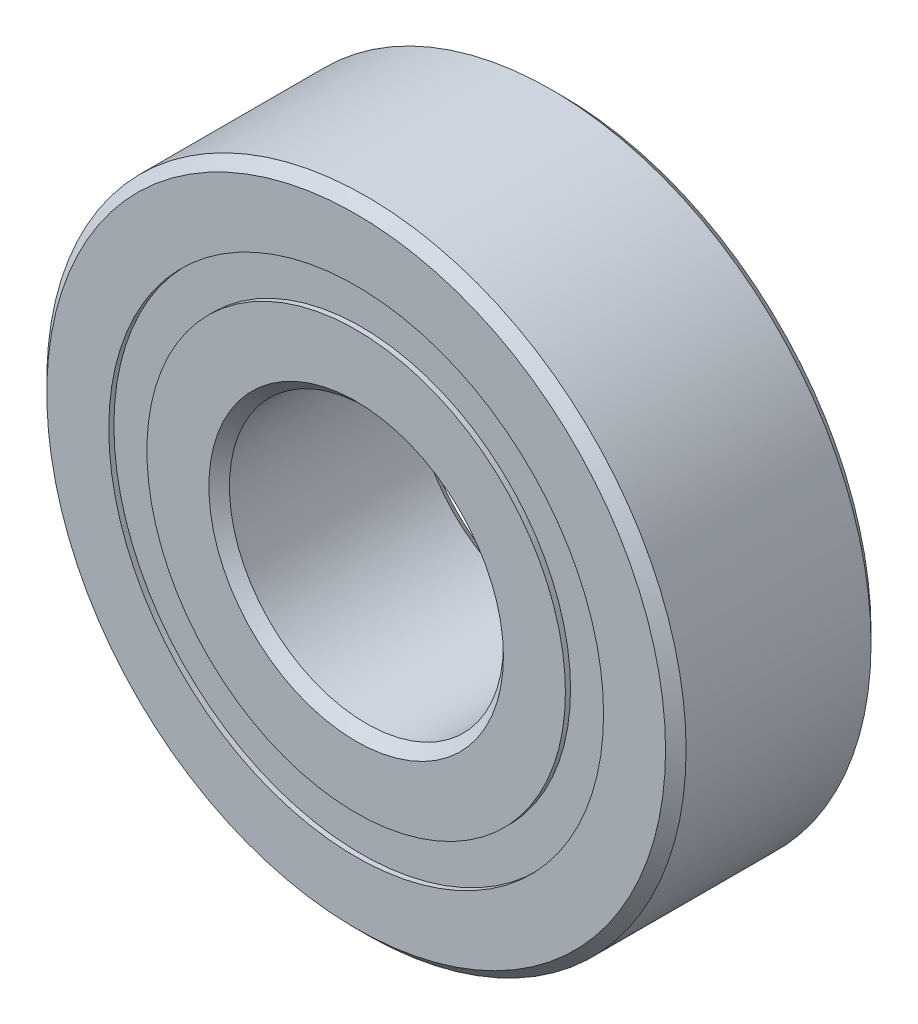
ISO-10303-21;
HEADER;
FILE_DESCRIPTION(('STEP AP214'),'2;1');
FILE_NAME('part.step','',(''),(''),'','','');
FILE_SCHEMA(('AUTOMOTIVE_DESIGN { 1 0 10303 214 1 1 1 1 }'));
ENDSEC;
DATA;
#1=APPLICATION_CONTEXT('core data for automotive mechanical design processes');
#2=APPLICATION_PROTOCOL_DEFINITION('international standard','automotive_design',2000,#1);
#3=PRODUCT_CONTEXT('',#1,'mechanical');
#4=PRODUCT('Part','Part','',(#3));
#5=PRODUCT_RELATED_PRODUCT_CATEGORY('part','',(#4));
#6=PRODUCT_DEFINITION_FORMATION('','',#4);
#7=PRODUCT_DEFINITION_CONTEXT('part definition',#1,'design');
#8=PRODUCT_DEFINITION('design','',#6,#7);
#9=PRODUCT_DEFINITION_SHAPE('','',#8);
#10=(LENGTH_UNIT() NAMED_UNIT(*) SI_UNIT(.MILLI.,.METRE.));
#11=(NAMED_UNIT(*) PLANE_ANGLE_UNIT() SI_UNIT($,.RADIAN.));
#12=(NAMED_UNIT(*) SI_UNIT($,.STERADIAN.) SOLID_ANGLE_UNIT());
#13=UNCERTAINTY_MEASURE_WITH_UNIT(LENGTH_MEASURE(1.E-05),#10,'distance_accuracy_value','');
#14=(GEOMETRIC_REPRESENTATION_CONTEXT(3) GLOBAL_UNCERTAINTY_ASSIGNED_CONTEXT((#13)) GLOBAL_UNIT_ASSIGNED_CONTEXT((#10,
#11,#12)) REPRESENTATION_CONTEXT('',''));
#15=CARTESIAN_POINT('',(0.,0.,0.));
#16=DIRECTION('',(0.,0.,1.));
#17=DIRECTION('',(1.,0.,0.));
#18=AXIS2_PLACEMENT_3D('',#15,#16,#17);
#19=CARTESIAN_POINT('',(0.,8.60041208791209,-3.39328125));
#20=DIRECTION('',(0.,0.,1.));
#21=DIRECTION('',(1.,0.,0.));
#22=AXIS2_PLACEMENT_3D('',#19,#20,#21);
#23=PLANE('',#22);
#24=CARTESIAN_POINT('',(0.,0.,-3.39328125));
#25=DIRECTION('',(0.,0.,1.));
#26=DIRECTION('',(1.,0.,0.));
#27=AXIS2_PLACEMENT_3D('',#24,#25,#26);
#28=CIRCLE('',#27,8.60041208791209);
#29=CARTESIAN_POINT('',(8.60041208791209,0.,-3.39328125));
#30=VERTEX_POINT('',#29);
#31=EDGE_CURVE('E63',#30,#30,#28,.T.);
#32=ORIENTED_EDGE('',*,*,#31,.F.);
#33=EDGE_LOOP('',(#32));
#34=FACE_BOUND('',#33,.T.);
#35=CARTESIAN_POINT('',(0.,0.,-3.39328125));
#36=DIRECTION('',(0.,0.,1.));
#37=DIRECTION('',(1.,0.,0.));
#38=AXIS2_PLACEMENT_3D('',#35,#36,#37);
#39=CIRCLE('',#38,7.27458791208791);
#40=CARTESIAN_POINT('',(7.27458791208791,0.,-3.39328125));
#41=VERTEX_POINT('',#40);
#42=EDGE_CURVE('E11',#41,#41,#39,.T.);
#43=ORIENTED_EDGE('',*,*,#42,.T.);
#44=EDGE_LOOP('',(#43));
#45=FACE_BOUND('',#44,.T.);
#46=ADVANCED_FACE('F45',(#34,#45),#23,.F.);
#47=CARTESIAN_POINT('',(0.,0.,3.571875));
#48=DIRECTION('',(0.,0.,1.));
#49=DIRECTION('',(1.,0.,0.));
#50=AXIS2_PLACEMENT_3D('',#47,#48,#49);
#51=CYLINDRICAL_SURFACE('',#50,7.27458791208791);
#52=ORIENTED_EDGE('',*,*,#42,.F.);
#53=EDGE_LOOP('',(#52));
#54=FACE_BOUND('',#53,.T.);
#55=CARTESIAN_POINT('',(0.,0.,-1.72035132641562));
#56=DIRECTION('',(0.,0.,1.));
#57=DIRECTION('',(1.,0.,0.));
#58=AXIS2_PLACEMENT_3D('',#55,#56,#57);
#59=CIRCLE('',#58,7.27458791208791);
#60=CARTESIAN_POINT('',(7.27458791208791,0.,-1.72035132641562));
#61=VERTEX_POINT('',#60);
#62=EDGE_CURVE('E52',#61,#61,#59,.T.);
#63=ORIENTED_EDGE('',*,*,#62,.T.);
#64=EDGE_LOOP('',(#63));
#65=FACE_BOUND('',#64,.T.);
#66=ADVANCED_FACE('F72',(#54,#65),#51,.F.);
#67=CARTESIAN_POINT('',(0.,8.60041208791209,-1.72035132641562));
#68=DIRECTION('',(0.,0.,-1.));
#69=DIRECTION('',(-1.,0.,0.));
#70=AXIS2_PLACEMENT_3D('',#67,#68,#69);
#71=PLANE('',#70);
#72=ORIENTED_EDGE('',*,*,#62,.F.);
#73=EDGE_LOOP('',(#72));
#74=FACE_BOUND('',#73,.T.);
#75=CARTESIAN_POINT('',(0.,0.,-1.72035132641562));
#76=DIRECTION('',(0.,0.,1.));
#77=DIRECTION('',(1.,0.,0.));
#78=AXIS2_PLACEMENT_3D('',#75,#76,#77);
#79=CIRCLE('',#78,8.60041208791209);
#80=CARTESIAN_POINT('',(8.60041208791209,0.,-1.72035132641562));
#81=VERTEX_POINT('',#80);
#82=EDGE_CURVE('E58',#81,#81,#79,.T.);
#83=ORIENTED_EDGE('',*,*,#82,.T.);
#84=EDGE_LOOP('',(#83));
#85=FACE_BOUND('',#84,.T.);
#86=ADVANCED_FACE('F76',(#74,#85),#71,.F.);
#87=CARTESIAN_POINT('',(0.,0.,3.571875));
#88=DIRECTION('',(0.,0.,1.));
#89=DIRECTION('',(1.,0.,0.));
#90=AXIS2_PLACEMENT_3D('',#87,#88,#89);
#91=CYLINDRICAL_SURFACE('',#90,8.60041208791209);
#92=ORIENTED_EDGE('',*,*,#82,.F.);
#93=EDGE_LOOP('',(#92));
#94=FACE_BOUND('',#93,.T.);
#95=ORIENTED_EDGE('',*,*,#31,.T.);
#96=EDGE_LOOP('',(#95));
#97=FACE_BOUND('',#96,.T.);
#98=ADVANCED_FACE('F69',(#94,#97),#91,.T.);
#99=CLOSED_SHELL('',(#46,#66,#86,#98));
#100=MANIFOLD_SOLID_BREP('B2',#99);
#101=CARTESIAN_POINT('',(0.,8.60041208791209,3.39328125));
#102=DIRECTION('',(0.,0.,-1.));
#103=DIRECTION('',(-1.,0.,0.));
#104=AXIS2_PLACEMENT_3D('',#101,#102,#103);
#105=PLANE('',#104);
#106=CARTESIAN_POINT('',(0.,0.,3.39328125));
#107=DIRECTION('',(0.,0.,1.));
#108=DIRECTION('',(1.,0.,0.));
#109=AXIS2_PLACEMENT_3D('',#106,#107,#108);
#110=CIRCLE('',#109,7.27458791208791);
#111=CARTESIAN_POINT('',(7.27458791208791,0.,3.39328125));
#112=VERTEX_POINT('',#111);
#113=EDGE_CURVE('E44',#112,#112,#110,.T.);
#114=ORIENTED_EDGE('',*,*,#113,.F.);
#115=EDGE_LOOP('',(#114));
#116=FACE_BOUND('',#115,.T.);
#117=CARTESIAN_POINT('',(0.,0.,3.39328125));
#118=DIRECTION('',(0.,0.,1.));
#119=DIRECTION('',(1.,0.,0.));
#120=AXIS2_PLACEMENT_3D('',#117,#118,#119);
#121=CIRCLE('',#120,8.60041208791209);
#122=CARTESIAN_POINT('',(8.60041208791209,0.,3.39328125));
#123=VERTEX_POINT('',#122);
#124=EDGE_CURVE('E134',#123,#123,#121,.T.);
#125=ORIENTED_EDGE('',*,*,#124,.T.);
#126=EDGE_LOOP('',(#125));
#127=FACE_BOUND('',#126,.T.);
#128=ADVANCED_FACE('F116',(#116,#127),#105,.F.);
#129=CARTESIAN_POINT('',(0.,0.,3.571875));
#130=DIRECTION('',(0.,0.,1.));
#131=DIRECTION('',(1.,0.,0.));
#132=AXIS2_PLACEMENT_3D('',#129,#130,#131);
#133=CYLINDRICAL_SURFACE('',#132,7.27458791208791);
#134=CARTESIAN_POINT('',(0.,0.,1.72035132641561));
#135=DIRECTION('',(0.,0.,1.));
#136=DIRECTION('',(1.,0.,0.));
#137=AXIS2_PLACEMENT_3D('',#134,#135,#136);
#138=CIRCLE('',#137,7.27458791208791);
#139=CARTESIAN_POINT('',(7.27458791208791,0.,1.72035132641561));
#140=VERTEX_POINT('',#139);
#141=EDGE_CURVE('E123',#140,#140,#138,.T.);
#142=ORIENTED_EDGE('',*,*,#141,.F.);
#143=EDGE_LOOP('',(#142));
#144=FACE_BOUND('',#143,.T.);
#145=ORIENTED_EDGE('',*,*,#113,.T.);
#146=EDGE_LOOP('',(#145));
#147=FACE_BOUND('',#146,.T.);
#148=ADVANCED_FACE('F149',(#144,#147),#133,.F.);
#149=CARTESIAN_POINT('',(0.,8.60041208791209,1.72035132641561));
#150=DIRECTION('',(0.,0.,1.));
#151=DIRECTION('',(1.,0.,0.));
#152=AXIS2_PLACEMENT_3D('',#149,#150,#151);
#153=PLANE('',#152);
#154=CARTESIAN_POINT('',(0.,0.,1.72035132641561));
#155=DIRECTION('',(0.,0.,1.));
#156=DIRECTION('',(1.,0.,0.));
#157=AXIS2_PLACEMENT_3D('',#154,#155,#156);
#158=CIRCLE('',#157,8.60041208791209);
#159=CARTESIAN_POINT('',(8.60041208791209,0.,1.72035132641561));
#160=VERTEX_POINT('',#159);
#161=EDGE_CURVE('E128',#160,#160,#158,.T.);
#162=ORIENTED_EDGE('',*,*,#161,.F.);
#163=EDGE_LOOP('',(#162));
#164=FACE_BOUND('',#163,.T.);
#165=ORIENTED_EDGE('',*,*,#141,.T.);
#166=EDGE_LOOP('',(#165));
#167=FACE_BOUND('',#166,.T.);
#168=ADVANCED_FACE('F144',(#164,#167),#153,.F.);
#169=CARTESIAN_POINT('',(0.,0.,3.571875));
#170=DIRECTION('',(0.,0.,1.));
#171=DIRECTION('',(1.,0.,0.));
#172=AXIS2_PLACEMENT_3D('',#169,#170,#171);
#173=CYLINDRICAL_SURFACE('',#172,8.60041208791209);
#174=ORIENTED_EDGE('',*,*,#124,.F.);
#175=EDGE_LOOP('',(#174));
#176=FACE_BOUND('',#175,.T.);
#177=ORIENTED_EDGE('',*,*,#161,.T.);
#178=EDGE_LOOP('',(#177));
#179=FACE_BOUND('',#178,.T.);
#180=ADVANCED_FACE('F141',(#176,#179),#173,.T.);
#181=CLOSED_SHELL('',(#128,#148,#168,#180));
#182=MANIFOLD_SOLID_BREP('B6',#181);
#183=CARTESIAN_POINT('',(-4.66554544007142,6.42157239285121,0.));
#184=DIRECTION('',(0.,0.,1.));
#185=DIRECTION('',(-0.587785252292462,0.809016994374955,0.));
#186=AXIS2_PLACEMENT_3D('',#183,#184,#185);
#187=SPHERICAL_SURFACE('',#186,1.72035132641561);
#188=CARTESIAN_POINT('',(-4.66554544007142,6.42157239285121,1.72035132641561));
#189=VERTEX_POINT('',#188);
#190=VERTEX_LOOP('',#189);
#191=FACE_BOUND('',#190,.T.);
#192=ADVANCED_FACE('F190',(#191),#187,.T.);
#193=CLOSED_SHELL('',(#192));
#194=MANIFOLD_SOLID_BREP('B39',#193);
#195=CARTESIAN_POINT('',(-7.54901109809275,2.45282239285123,0.));
#196=DIRECTION('',(0.,0.,1.));
#197=DIRECTION('',(-0.95105651629515,0.309016994374958,0.));
#198=AXIS2_PLACEMENT_3D('',#195,#196,#197);
#199=SPHERICAL_SURFACE('',#198,1.72035132641561);
#200=CARTESIAN_POINT('',(-7.54901109809275,2.45282239285123,1.72035132641561));
#201=VERTEX_POINT('',#200);
#202=VERTEX_LOOP('',#201);
#203=FACE_BOUND('',#202,.T.);
#204=ADVANCED_FACE('F210',(#203),#199,.T.);
#205=CLOSED_SHELL('',(#204));
#206=MANIFOLD_SOLID_BREP('B112',#205);
#207=CARTESIAN_POINT('',(-7.54901109809281,-2.45282239285107,0.));
#208=DIRECTION('',(0.,0.,1.));
#209=DIRECTION('',(-0.951056516295157,-0.309016994374938,0.));
#210=AXIS2_PLACEMENT_3D('',#207,#208,#209);
#211=SPHERICAL_SURFACE('',#210,1.72035132641561);
#212=CARTESIAN_POINT('',(-7.54901109809281,-2.45282239285107,1.72035132641561));
#213=VERTEX_POINT('',#212);
#214=VERTEX_LOOP('',#213);
#215=FACE_BOUND('',#214,.T.);
#216=ADVANCED_FACE('F230',(#215),#211,.T.);
#217=CLOSED_SHELL('',(#216));
#218=MANIFOLD_SOLID_BREP('B186',#217);
#219=CARTESIAN_POINT('',(-4.66554544007156,-6.4215723928511,0.));
#220=DIRECTION('',(0.,0.,1.));
#221=DIRECTION('',(-0.58778525229248,-0.809016994374942,0.));
#222=AXIS2_PLACEMENT_3D('',#219,#220,#221);
#223=SPHERICAL_SURFACE('',#222,1.72035132641561);
#224=CARTESIAN_POINT('',(-4.66554544007156,-6.4215723928511,1.72035132641561));
#225=VERTEX_POINT('',#224);
#226=VERTEX_LOOP('',#225);
#227=FACE_BOUND('',#226,.T.);
#228=ADVANCED_FACE('F250',(#227),#223,.T.);
#229=CLOSED_SHELL('',(#228));
#230=MANIFOLD_SOLID_BREP('B206',#229);
#231=CARTESIAN_POINT('',(0.,-7.9375,0.));
#232=DIRECTION('',(0.,0.,1.));
#233=DIRECTION('',(0.,-1.,0.));
#234=AXIS2_PLACEMENT_3D('',#231,#232,#233);
#235=SPHERICAL_SURFACE('',#234,1.72035132641561);
#236=CARTESIAN_POINT('',(0.,-7.9375,1.72035132641561));
#237=VERTEX_POINT('',#236);
#238=VERTEX_LOOP('',#237);
#239=FACE_BOUND('',#238,.T.);
#240=ADVANCED_FACE('F270',(#239),#235,.T.);
#241=CLOSED_SHELL('',(#240));
#242=MANIFOLD_SOLID_BREP('B226',#241);
#243=CARTESIAN_POINT('',(4.66554544007147,-6.42157239285117,0.));
#244=DIRECTION('',(0.,0.,1.));
#245=DIRECTION('',(0.587785252292469,-0.809016994374951,0.));
#246=AXIS2_PLACEMENT_3D('',#243,#244,#245);
#247=SPHERICAL_SURFACE('',#246,1.72035132641561);
#248=CARTESIAN_POINT('',(4.66554544007147,-6.42157239285117,1.72035132641561));
#249=VERTEX_POINT('',#248);
#250=VERTEX_LOOP('',#249);
#251=FACE_BOUND('',#250,.T.);
#252=ADVANCED_FACE('F291',(#251),#247,.T.);
#253=CLOSED_SHELL('',(#252));
#254=MANIFOLD_SOLID_BREP('B246',#253);
#255=CARTESIAN_POINT('',(7.54901109809277,-2.45282239285118,0.));
#256=DIRECTION('',(0.,0.,1.));
#257=DIRECTION('',(0.951056516295152,-0.309016994374952,0.));
#258=AXIS2_PLACEMENT_3D('',#255,#256,#257);
#259=SPHERICAL_SURFACE('',#258,1.72035132641561);
#260=CARTESIAN_POINT('',(7.54901109809277,-2.45282239285118,1.72035132641561));
#261=VERTEX_POINT('',#260);
#262=VERTEX_LOOP('',#261);
#263=FACE_BOUND('',#262,.T.);
#264=ADVANCED_FACE('F312',(#263),#259,.T.);
#265=CLOSED_SHELL('',(#264));
#266=MANIFOLD_SOLID_BREP('B266',#265);
#267=CARTESIAN_POINT('',(7.54901109809279,2.45282239285112,0.));
#268=DIRECTION('',(0.,0.,1.));
#269=DIRECTION('',(0.951056516295155,0.309016994374945,0.));
#270=AXIS2_PLACEMENT_3D('',#267,#268,#269);
#271=SPHERICAL_SURFACE('',#270,1.72035132641561);
#272=CARTESIAN_POINT('',(7.54901109809279,2.45282239285112,1.72035132641561));
#273=VERTEX_POINT('',#272);
#274=VERTEX_LOOP('',#273);
#275=FACE_BOUND('',#274,.T.);
#276=ADVANCED_FACE('F333',(#275),#271,.T.);
#277=CLOSED_SHELL('',(#276));
#278=MANIFOLD_SOLID_BREP('B287',#277);
#279=CARTESIAN_POINT('',(4.66554544007152,6.42157239285114,0.));
#280=DIRECTION('',(0.,0.,1.));
#281=DIRECTION('',(0.587785252292474,0.809016994374947,0.));
#282=AXIS2_PLACEMENT_3D('',#279,#280,#281);
#283=SPHERICAL_SURFACE('',#282,1.72035132641561);
#284=CARTESIAN_POINT('',(4.66554544007152,6.42157239285114,1.72035132641561));
#285=VERTEX_POINT('',#284);
#286=VERTEX_LOOP('',#285);
#287=FACE_BOUND('',#286,.T.);
#288=ADVANCED_FACE('F353',(#287),#283,.T.);
#289=CLOSED_SHELL('',(#288));
#290=MANIFOLD_SOLID_BREP('B308',#289);
#291=CARTESIAN_POINT('',(0.,7.9375,0.));
#292=DIRECTION('',(0.,0.,1.));
#293=DIRECTION('',(0.,1.,0.));
#294=AXIS2_PLACEMENT_3D('',#291,#292,#293);
#295=SPHERICAL_SURFACE('',#294,1.72035132641561);
#296=CARTESIAN_POINT('',(0.,7.9375,1.72035132641561));
#297=VERTEX_POINT('',#296);
#298=VERTEX_LOOP('',#297);
#299=FACE_BOUND('',#298,.T.);
#300=ADVANCED_FACE('F375',(#299),#295,.T.);
#301=CLOSED_SHELL('',(#300));
#302=MANIFOLD_SOLID_BREP('B329',#301);
#303=CARTESIAN_POINT('',(0.,7.27458791208791,3.571875));
#304=DIRECTION('',(0.,0.,-1.));
#305=DIRECTION('',(-1.,0.,0.));
#306=AXIS2_PLACEMENT_3D('',#303,#304,#305);
#307=PLANE('',#306);
#308=CARTESIAN_POINT('',(0.,0.,3.571875));
#309=DIRECTION('',(0.,0.,1.));
#310=DIRECTION('',(1.,0.,0.));
#311=AXIS2_PLACEMENT_3D('',#308,#309,#310);
#312=CIRCLE('',#311,5.1196875);
#313=CARTESIAN_POINT('',(5.1196875,0.,3.571875));
#314=VERTEX_POINT('',#313);
#315=EDGE_CURVE('E430',#314,#314,#312,.T.);
#316=ORIENTED_EDGE('',*,*,#315,.F.);
#317=EDGE_LOOP('',(#316));
#318=FACE_BOUND('',#317,.T.);
#319=CARTESIAN_POINT('',(0.,0.,3.571875));
#320=DIRECTION('',(0.,0.,1.));
#321=DIRECTION('',(1.,0.,0.));
#322=AXIS2_PLACEMENT_3D('',#319,#320,#321);
#323=CIRCLE('',#322,7.27458791208791);
#324=CARTESIAN_POINT('',(7.27458791208791,0.,3.571875));
#325=VERTEX_POINT('',#324);
#326=EDGE_CURVE('E374',#325,#325,#323,.T.);
#327=ORIENTED_EDGE('',*,*,#326,.T.);
#328=EDGE_LOOP('',(#327));
#329=FACE_BOUND('',#328,.T.);
#330=ADVANCED_FACE('F394',(#318,#329),#307,.F.);
#331=CARTESIAN_POINT('',(0.,0.,3.571875));
#332=DIRECTION('',(0.,0.,1.));
#333=DIRECTION('',(1.,0.,0.));
#334=AXIS2_PLACEMENT_3D('',#331,#332,#333);
#335=CYLINDRICAL_SURFACE('',#334,7.27458791208791);
#336=ORIENTED_EDGE('',*,*,#326,.F.);
#337=EDGE_LOOP('',(#336));
#338=FACE_BOUND('',#337,.T.);
#339=CARTESIAN_POINT('',(0.,0.,1.5875));
#340=DIRECTION('',(0.,0.,1.));
#341=DIRECTION('',(1.,0.,0.));
#342=AXIS2_PLACEMENT_3D('',#339,#340,#341);
#343=CIRCLE('',#342,7.27458791208791);
#344=CARTESIAN_POINT('',(7.27458791208791,0.,1.5875));
#345=VERTEX_POINT('',#344);
#346=EDGE_CURVE('E401',#345,#345,#343,.T.);
#347=ORIENTED_EDGE('',*,*,#346,.T.);
#348=EDGE_LOOP('',(#347));
#349=FACE_BOUND('',#348,.T.);
#350=ADVANCED_FACE('F437',(#338,#349),#335,.T.);
#351=CARTESIAN_POINT('',(0.,0.,0.));
#352=DIRECTION('',(0.,0.,1.));
#353=DIRECTION('',(1.,0.,0.));
#354=AXIS2_PLACEMENT_3D('',#351,#352,#353);
#355=TOROIDAL_SURFACE('',#354,7.93749999999999,1.72035132641561);
#356=ORIENTED_EDGE('',*,*,#346,.F.);
#357=EDGE_LOOP('',(#356));
#358=FACE_BOUND('',#357,.T.);
#359=CARTESIAN_POINT('',(0.,0.,-1.5875));
#360=DIRECTION('',(0.,0.,1.));
#361=DIRECTION('',(1.,0.,0.));
#362=AXIS2_PLACEMENT_3D('',#359,#360,#361);
#363=CIRCLE('',#362,7.27458791208791);
#364=CARTESIAN_POINT('',(7.27458791208791,0.,-1.5875));
#365=VERTEX_POINT('',#364);
#366=EDGE_CURVE('E406',#365,#365,#363,.T.);
#367=ORIENTED_EDGE('',*,*,#366,.T.);
#368=EDGE_LOOP('',(#367));
#369=FACE_BOUND('',#368,.T.);
#370=ADVANCED_FACE('F441',(#358,#369),#355,.F.);
#371=CARTESIAN_POINT('',(0.,0.,3.571875));
#372=DIRECTION('',(0.,0.,1.));
#373=DIRECTION('',(1.,0.,0.));
#374=AXIS2_PLACEMENT_3D('',#371,#372,#373);
#375=CYLINDRICAL_SURFACE('',#374,7.27458791208791);
#376=ORIENTED_EDGE('',*,*,#366,.F.);
#377=EDGE_LOOP('',(#376));
#378=FACE_BOUND('',#377,.T.);
#379=CARTESIAN_POINT('',(0.,0.,-3.571875));
#380=DIRECTION('',(0.,0.,1.));
#381=DIRECTION('',(1.,0.,0.));
#382=AXIS2_PLACEMENT_3D('',#379,#380,#381);
#383=CIRCLE('',#382,7.27458791208791);
#384=CARTESIAN_POINT('',(7.27458791208791,0.,-3.571875));
#385=VERTEX_POINT('',#384);
#386=EDGE_CURVE('E412',#385,#385,#383,.T.);
#387=ORIENTED_EDGE('',*,*,#386,.T.);
#388=EDGE_LOOP('',(#387));
#389=FACE_BOUND('',#388,.T.);
#390=ADVANCED_FACE('F446',(#378,#389),#375,.T.);
#391=CARTESIAN_POINT('',(0.,5.1196875,-3.571875));
#392=DIRECTION('',(0.,0.,1.));
#393=DIRECTION('',(1.,0.,0.));
#394=AXIS2_PLACEMENT_3D('',#391,#392,#393);
#395=PLANE('',#394);
#396=ORIENTED_EDGE('',*,*,#386,.F.);
#397=EDGE_LOOP('',(#396));
#398=FACE_BOUND('',#397,.T.);
#399=CARTESIAN_POINT('',(0.,0.,-3.571875));
#400=DIRECTION('',(0.,0.,1.));
#401=DIRECTION('',(1.,0.,0.));
#402=AXIS2_PLACEMENT_3D('',#399,#400,#401);
#403=CIRCLE('',#402,5.1196875);
#404=CARTESIAN_POINT('',(5.1196875,0.,-3.571875));
#405=VERTEX_POINT('',#404);
#406=EDGE_CURVE('E418',#405,#405,#403,.T.);
#407=ORIENTED_EDGE('',*,*,#406,.T.);
#408=EDGE_LOOP('',(#407));
#409=FACE_BOUND('',#408,.T.);
#410=ADVANCED_FACE('F452',(#398,#409),#395,.F.);
#411=CARTESIAN_POINT('',(0.,0.,-3.2146875));
#412=DIRECTION('',(0.,0.,-1.));
#413=DIRECTION('',(-1.,0.,0.));
#414=AXIS2_PLACEMENT_3D('',#411,#412,#413);
#415=CONICAL_SURFACE('',#414,4.7625,0.785398163397444);
#416=ORIENTED_EDGE('',*,*,#406,.F.);
#417=EDGE_LOOP('',(#416));
#418=FACE_BOUND('',#417,.T.);
#419=CARTESIAN_POINT('',(0.,0.,-3.2146875));
#420=DIRECTION('',(0.,0.,1.));
#421=DIRECTION('',(1.,0.,0.));
#422=AXIS2_PLACEMENT_3D('',#419,#420,#421);
#423=CIRCLE('',#422,4.7625);
#424=CARTESIAN_POINT('',(4.7625,0.,-3.2146875));
#425=VERTEX_POINT('',#424);
#426=EDGE_CURVE('E422',#425,#425,#423,.T.);
#427=ORIENTED_EDGE('',*,*,#426,.T.);
#428=EDGE_LOOP('',(#427));
#429=FACE_BOUND('',#428,.T.);
#430=ADVANCED_FACE('F456',(#418,#429),#415,.F.);
#431=CARTESIAN_POINT('',(0.,0.,3.571875));
#432=DIRECTION('',(0.,0.,1.));
#433=DIRECTION('',(1.,0.,0.));
#434=AXIS2_PLACEMENT_3D('',#431,#432,#433);
#435=CYLINDRICAL_SURFACE('',#434,4.7625);
#436=ORIENTED_EDGE('',*,*,#426,.F.);
#437=EDGE_LOOP('',(#436));
#438=FACE_BOUND('',#437,.T.);
#439=CARTESIAN_POINT('',(0.,0.,3.2146875));
#440=DIRECTION('',(0.,0.,1.));
#441=DIRECTION('',(1.,0.,0.));
#442=AXIS2_PLACEMENT_3D('',#439,#440,#441);
#443=CIRCLE('',#442,4.7625);
#444=CARTESIAN_POINT('',(4.7625,0.,3.2146875));
#445=VERTEX_POINT('',#444);
#446=EDGE_CURVE('E426',#445,#445,#443,.T.);
#447=ORIENTED_EDGE('',*,*,#446,.T.);
#448=EDGE_LOOP('',(#447));
#449=FACE_BOUND('',#448,.T.);
#450=ADVANCED_FACE('F460',(#438,#449),#435,.F.);
#451=CARTESIAN_POINT('',(0.,0.,3.571875));
#452=DIRECTION('',(0.,0.,1.));
#453=DIRECTION('',(1.,0.,0.));
#454=AXIS2_PLACEMENT_3D('',#451,#452,#453);
#455=CONICAL_SURFACE('',#454,5.1196875,0.785398163397453);
#456=ORIENTED_EDGE('',*,*,#446,.F.);
#457=EDGE_LOOP('',(#456));
#458=FACE_BOUND('',#457,.T.);
#459=ORIENTED_EDGE('',*,*,#315,.T.);
#460=EDGE_LOOP('',(#459));
#461=FACE_BOUND('',#460,.T.);
#462=ADVANCED_FACE('F434',(#458,#461),#455,.F.);
#463=CLOSED_SHELL('',(#330,#350,#370,#390,#410,#430,#450,#462));
#464=MANIFOLD_SOLID_BREP('B349',#463);
#465=CARTESIAN_POINT('',(0.,0.,3.2146875));
#466=DIRECTION('',(0.,0.,-1.));
#467=DIRECTION('',(-1.,0.,0.));
#468=AXIS2_PLACEMENT_3D('',#465,#466,#467);
#469=CONICAL_SURFACE('',#468,11.1125,0.785398163397446);
#470=CARTESIAN_POINT('',(0.,0.,3.571875));
#471=DIRECTION('',(0.,0.,1.));
#472=DIRECTION('',(1.,0.,0.));
#473=AXIS2_PLACEMENT_3D('',#470,#471,#472);
#474=CIRCLE('',#473,10.7553125);
#475=CARTESIAN_POINT('',(10.7553125,0.,3.571875));
#476=VERTEX_POINT('',#475);
#477=EDGE_CURVE('E564',#476,#476,#474,.T.);
#478=ORIENTED_EDGE('',*,*,#477,.F.);
#479=EDGE_LOOP('',(#478));
#480=FACE_BOUND('',#479,.T.);
#481=CARTESIAN_POINT('',(0.,0.,3.2146875));
#482=DIRECTION('',(0.,0.,1.));
#483=DIRECTION('',(1.,0.,0.));
#484=AXIS2_PLACEMENT_3D('',#481,#482,#483);
#485=CIRCLE('',#484,11.1125);
#486=CARTESIAN_POINT('',(11.1125,0.,3.2146875));
#487=VERTEX_POINT('',#486);
#488=EDGE_CURVE('E393',#487,#487,#485,.T.);
#489=ORIENTED_EDGE('',*,*,#488,.T.);
#490=EDGE_LOOP('',(#489));
#491=FACE_BOUND('',#490,.T.);
#492=ADVANCED_FACE('F528',(#480,#491),#469,.T.);
#493=CARTESIAN_POINT('',(0.,0.,3.571875));
#494=DIRECTION('',(0.,0.,1.));
#495=DIRECTION('',(1.,0.,0.));
#496=AXIS2_PLACEMENT_3D('',#493,#494,#495);
#497=CYLINDRICAL_SURFACE('',#496,11.1125);
#498=ORIENTED_EDGE('',*,*,#488,.F.);
#499=EDGE_LOOP('',(#498));
#500=FACE_BOUND('',#499,.T.);
#501=CARTESIAN_POINT('',(0.,0.,-3.2146875));
#502=DIRECTION('',(0.,0.,1.));
#503=DIRECTION('',(1.,0.,0.));
#504=AXIS2_PLACEMENT_3D('',#501,#502,#503);
#505=CIRCLE('',#504,11.1125);
#506=CARTESIAN_POINT('',(11.1125,0.,-3.2146875));
#507=VERTEX_POINT('',#506);
#508=EDGE_CURVE('E535',#507,#507,#505,.T.);
#509=ORIENTED_EDGE('',*,*,#508,.T.);
#510=EDGE_LOOP('',(#509));
#511=FACE_BOUND('',#510,.T.);
#512=ADVANCED_FACE('F571',(#500,#511),#497,.T.);
#513=CARTESIAN_POINT('',(0.,0.,-3.571875));
#514=DIRECTION('',(0.,0.,1.));
#515=DIRECTION('',(1.,0.,0.));
#516=AXIS2_PLACEMENT_3D('',#513,#514,#515);
#517=CONICAL_SURFACE('',#516,10.7553125,0.785398163397444);
#518=ORIENTED_EDGE('',*,*,#508,.F.);
#519=EDGE_LOOP('',(#518));
#520=FACE_BOUND('',#519,.T.);
#521=CARTESIAN_POINT('',(0.,0.,-3.571875));
#522=DIRECTION('',(0.,0.,1.));
#523=DIRECTION('',(1.,0.,0.));
#524=AXIS2_PLACEMENT_3D('',#521,#522,#523);
#525=CIRCLE('',#524,10.7553125);
#526=CARTESIAN_POINT('',(10.7553125,0.,-3.571875));
#527=VERTEX_POINT('',#526);
#528=EDGE_CURVE('E542',#527,#527,#525,.T.);
#529=ORIENTED_EDGE('',*,*,#528,.T.);
#530=EDGE_LOOP('',(#529));
#531=FACE_BOUND('',#530,.T.);
#532=ADVANCED_FACE('F575',(#520,#531),#517,.T.);
#533=CARTESIAN_POINT('',(0.,10.7553125,-3.571875));
#534=DIRECTION('',(0.,0.,1.));
#535=DIRECTION('',(1.,0.,0.));
#536=AXIS2_PLACEMENT_3D('',#533,#534,#535);
#537=PLANE('',#536);
#538=ORIENTED_EDGE('',*,*,#528,.F.);
#539=EDGE_LOOP('',(#538));
#540=FACE_BOUND('',#539,.T.);
#541=CARTESIAN_POINT('',(0.,0.,-3.571875));
#542=DIRECTION('',(0.,0.,1.));
#543=DIRECTION('',(1.,0.,0.));
#544=AXIS2_PLACEMENT_3D('',#541,#542,#543);
#545=CIRCLE('',#544,8.60041208791209);
#546=CARTESIAN_POINT('',(8.60041208791209,0.,-3.571875));
#547=VERTEX_POINT('',#546);
#548=EDGE_CURVE('E547',#547,#547,#545,.T.);
#549=ORIENTED_EDGE('',*,*,#548,.T.);
#550=EDGE_LOOP('',(#549));
#551=FACE_BOUND('',#550,.T.);
#552=ADVANCED_FACE('F580',(#540,#551),#537,.F.);
#553=CARTESIAN_POINT('',(0.,0.,3.571875));
#554=DIRECTION('',(0.,0.,1.));
#555=DIRECTION('',(1.,0.,0.));
#556=AXIS2_PLACEMENT_3D('',#553,#554,#555);
#557=CYLINDRICAL_SURFACE('',#556,8.60041208791209);
#558=ORIENTED_EDGE('',*,*,#548,.F.);
#559=EDGE_LOOP('',(#558));
#560=FACE_BOUND('',#559,.T.);
#561=CARTESIAN_POINT('',(0.,0.,-1.5875));
#562=DIRECTION('',(0.,0.,1.));
#563=DIRECTION('',(1.,0.,0.));
#564=AXIS2_PLACEMENT_3D('',#561,#562,#563);
#565=CIRCLE('',#564,8.60041208791209);
#566=CARTESIAN_POINT('',(8.60041208791209,0.,-1.5875));
#567=VERTEX_POINT('',#566);
#568=EDGE_CURVE('E553',#567,#567,#565,.T.);
#569=ORIENTED_EDGE('',*,*,#568,.T.);
#570=EDGE_LOOP('',(#569));
#571=FACE_BOUND('',#570,.T.);
#572=ADVANCED_FACE('F586',(#560,#571),#557,.F.);
#573=CARTESIAN_POINT('',(0.,0.,0.));
#574=DIRECTION('',(0.,0.,1.));
#575=DIRECTION('',(1.,0.,0.));
#576=AXIS2_PLACEMENT_3D('',#573,#574,#575);
#577=TOROIDAL_SURFACE('',#576,7.9375,1.72035132641561);
#578=ORIENTED_EDGE('',*,*,#568,.F.);
#579=EDGE_LOOP('',(#578));
#580=FACE_BOUND('',#579,.T.);
#581=CARTESIAN_POINT('',(0.,0.,1.5875));
#582=DIRECTION('',(0.,0.,1.));
#583=DIRECTION('',(1.,0.,0.));
#584=AXIS2_PLACEMENT_3D('',#581,#582,#583);
#585=CIRCLE('',#584,8.60041208791209);
#586=CARTESIAN_POINT('',(8.60041208791209,0.,1.5875));
#587=VERTEX_POINT('',#586);
#588=EDGE_CURVE('E557',#587,#587,#585,.T.);
#589=ORIENTED_EDGE('',*,*,#588,.T.);
#590=EDGE_LOOP('',(#589));
#591=FACE_BOUND('',#590,.T.);
#592=ADVANCED_FACE('F590',(#580,#591),#577,.F.);
#593=CARTESIAN_POINT('',(0.,0.,3.571875));
#594=DIRECTION('',(0.,0.,1.));
#595=DIRECTION('',(1.,0.,0.));
#596=AXIS2_PLACEMENT_3D('',#593,#594,#595);
#597=CYLINDRICAL_SURFACE('',#596,8.60041208791209);
#598=ORIENTED_EDGE('',*,*,#588,.F.);
#599=EDGE_LOOP('',(#598));
#600=FACE_BOUND('',#599,.T.);
#601=CARTESIAN_POINT('',(0.,0.,3.571875));
#602=DIRECTION('',(0.,0.,1.));
#603=DIRECTION('',(1.,0.,0.));
#604=AXIS2_PLACEMENT_3D('',#601,#602,#603);
#605=CIRCLE('',#604,8.60041208791209);
#606=CARTESIAN_POINT('',(8.60041208791209,0.,3.571875));
#607=VERTEX_POINT('',#606);
#608=EDGE_CURVE('E560',#607,#607,#605,.T.);
#609=ORIENTED_EDGE('',*,*,#608,.T.);
#610=EDGE_LOOP('',(#609));
#611=FACE_BOUND('',#610,.T.);
#612=ADVANCED_FACE('F594',(#600,#611),#597,.F.);
#613=CARTESIAN_POINT('',(0.,10.7553125,3.571875));
#614=DIRECTION('',(0.,0.,-1.));
#615=DIRECTION('',(-1.,0.,0.));
#616=AXIS2_PLACEMENT_3D('',#613,#614,#615);
#617=PLANE('',#616);
#618=ORIENTED_EDGE('',*,*,#608,.F.);
#619=EDGE_LOOP('',(#618));
#620=FACE_BOUND('',#619,.T.);
#621=ORIENTED_EDGE('',*,*,#477,.T.);
#622=EDGE_LOOP('',(#621));
#623=FACE_BOUND('',#622,.T.);
#624=ADVANCED_FACE('F568',(#620,#623),#617,.F.);
#625=CLOSED_SHELL('',(#492,#512,#532,#552,#572,#592,#612,#624));
#626=MANIFOLD_SOLID_BREP('B369',#625);
#627=ADVANCED_BREP_SHAPE_REPRESENTATION('',(#18,#100,#182,#194,#206,#218,#230,#242,#254,#266,
#278,#290,#302,#464,#626),#14);
#628=SHAPE_DEFINITION_REPRESENTATION(#9,#627);
ENDSEC;
END-ISO-10303-21;
